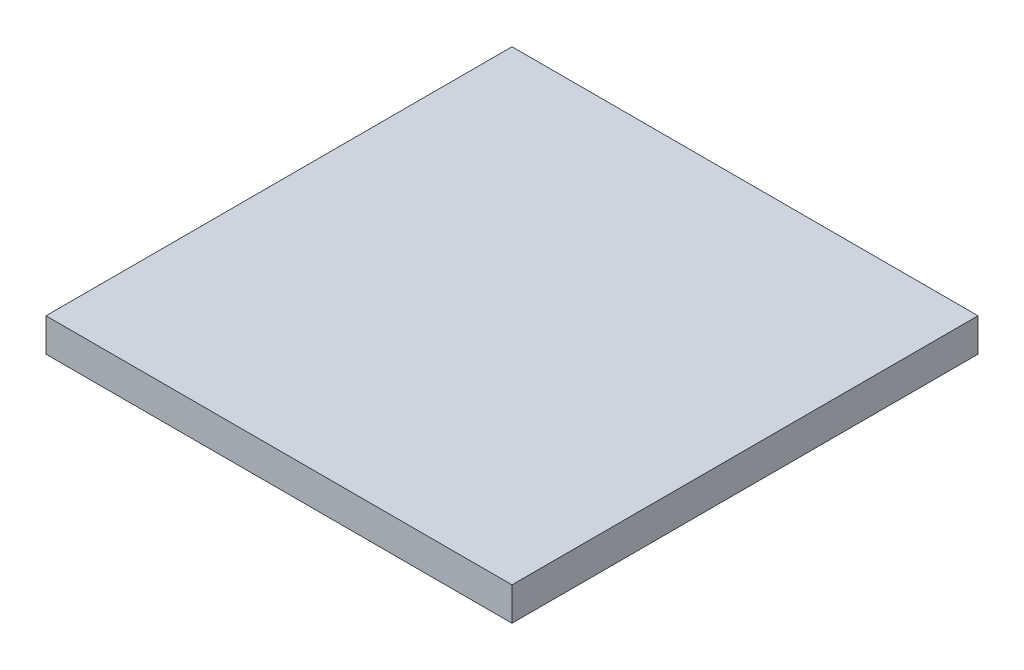
ISO-10303-21;
HEADER;
FILE_DESCRIPTION(('STEP AP214'),'2;1');
FILE_NAME('part.step','',(''),(''),'','','');
FILE_SCHEMA(('AUTOMOTIVE_DESIGN { 1 0 10303 214 1 1 1 1 }'));
ENDSEC;
DATA;
#1=APPLICATION_CONTEXT('core data for automotive mechanical design processes');
#2=APPLICATION_PROTOCOL_DEFINITION('international standard','automotive_design',2000,#1);
#3=PRODUCT_CONTEXT('',#1,'mechanical');
#4=PRODUCT('Part','Part','',(#3));
#5=PRODUCT_RELATED_PRODUCT_CATEGORY('part','',(#4));
#6=PRODUCT_DEFINITION_FORMATION('','',#4);
#7=PRODUCT_DEFINITION_CONTEXT('part definition',#1,'design');
#8=PRODUCT_DEFINITION('design','',#6,#7);
#9=PRODUCT_DEFINITION_SHAPE('','',#8);
#10=(LENGTH_UNIT() NAMED_UNIT(*) SI_UNIT(.MILLI.,.METRE.));
#11=(NAMED_UNIT(*) PLANE_ANGLE_UNIT() SI_UNIT($,.RADIAN.));
#12=(NAMED_UNIT(*) SI_UNIT($,.STERADIAN.) SOLID_ANGLE_UNIT());
#13=UNCERTAINTY_MEASURE_WITH_UNIT(LENGTH_MEASURE(1.E-05),#10,'distance_accuracy_value','');
#14=(GEOMETRIC_REPRESENTATION_CONTEXT(3) GLOBAL_UNCERTAINTY_ASSIGNED_CONTEXT((#13)) GLOBAL_UNIT_ASSIGNED_CONTEXT((#10,
#11,#12)) REPRESENTATION_CONTEXT('',''));
#15=CARTESIAN_POINT('',(0.,0.,0.));
#16=DIRECTION('',(0.,0.,1.));
#17=DIRECTION('',(1.,0.,0.));
#18=AXIS2_PLACEMENT_3D('',#15,#16,#17);
#19=CARTESIAN_POINT('',(0.,0.,0.));
#20=DIRECTION('',(0.,1.,0.));
#21=DIRECTION('',(0.,0.,1.));
#22=AXIS2_PLACEMENT_3D('',#19,#20,#21);
#23=PLANE('',#22);
#24=DIRECTION('',(-1.,0.,0.));
#25=VECTOR('',#24,1.);
#26=CARTESIAN_POINT('',(7.,0.,-7.));
#27=LINE('',#26,#25);
#28=CARTESIAN_POINT('',(7.,0.,-7.));
#29=VERTEX_POINT('',#28);
#30=CARTESIAN_POINT('',(-7.,0.,-7.));
#31=VERTEX_POINT('',#30);
#32=EDGE_CURVE('E19',#29,#31,#27,.T.);
#33=ORIENTED_EDGE('',*,*,#32,.F.);
#34=DIRECTION('',(0.,0.,-1.));
#35=VECTOR('',#34,1.);
#36=CARTESIAN_POINT('',(7.,0.,7.));
#37=LINE('',#36,#35);
#38=CARTESIAN_POINT('',(7.,0.,7.));
#39=VERTEX_POINT('',#38);
#40=EDGE_CURVE('E79',#39,#29,#37,.T.);
#41=ORIENTED_EDGE('',*,*,#40,.F.);
#42=DIRECTION('',(1.,0.,0.));
#43=VECTOR('',#42,1.);
#44=CARTESIAN_POINT('',(-7.,0.,7.));
#45=LINE('',#44,#43);
#46=CARTESIAN_POINT('',(-7.,0.,7.));
#47=VERTEX_POINT('',#46);
#48=EDGE_CURVE('E67',#47,#39,#45,.T.);
#49=ORIENTED_EDGE('',*,*,#48,.F.);
#50=DIRECTION('',(0.,0.,1.));
#51=VECTOR('',#50,1.);
#52=CARTESIAN_POINT('',(-7.,0.,-7.));
#53=LINE('',#52,#51);
#54=EDGE_CURVE('E54',#31,#47,#53,.T.);
#55=ORIENTED_EDGE('',*,*,#54,.F.);
#56=EDGE_LOOP('',(#33,#41,#49,#55));
#57=FACE_BOUND('',#56,.T.);
#58=ADVANCED_FACE('F16',(#57),#23,.F.);
#59=CARTESIAN_POINT('',(7.,0.,-7.));
#60=DIRECTION('',(0.,0.,-1.));
#61=DIRECTION('',(-1.,0.,0.));
#62=AXIS2_PLACEMENT_3D('',#59,#60,#61);
#63=PLANE('',#62);
#64=ORIENTED_EDGE('',*,*,#32,.T.);
#65=DIRECTION('',(0.,1.,0.));
#66=VECTOR('',#65,1.);
#67=CARTESIAN_POINT('',(-7.,0.,-7.));
#68=LINE('',#67,#66);
#69=CARTESIAN_POINT('',(-7.,1.,-7.));
#70=VERTEX_POINT('',#69);
#71=EDGE_CURVE('E60',#70,#31,#68,.F.);
#72=ORIENTED_EDGE('',*,*,#71,.F.);
#73=DIRECTION('',(1.,0.,0.));
#74=VECTOR('',#73,1.);
#75=CARTESIAN_POINT('',(0.,1.,-7.));
#76=LINE('',#75,#74);
#77=CARTESIAN_POINT('',(7.,1.,-7.));
#78=VERTEX_POINT('',#77);
#79=EDGE_CURVE('E82',#78,#70,#76,.F.);
#80=ORIENTED_EDGE('',*,*,#79,.F.);
#81=DIRECTION('',(0.,1.,0.));
#82=VECTOR('',#81,1.);
#83=CARTESIAN_POINT('',(7.,0.,-7.));
#84=LINE('',#83,#82);
#85=EDGE_CURVE('E63',#29,#78,#84,.T.);
#86=ORIENTED_EDGE('',*,*,#85,.F.);
#87=EDGE_LOOP('',(#64,#72,#80,#86));
#88=FACE_BOUND('',#87,.T.);
#89=ADVANCED_FACE('F59',(#88),#63,.T.);
#90=CARTESIAN_POINT('',(-7.,0.,-7.));
#91=DIRECTION('',(-1.,0.,0.));
#92=DIRECTION('',(0.,0.,1.));
#93=AXIS2_PLACEMENT_3D('',#90,#91,#92);
#94=PLANE('',#93);
#95=ORIENTED_EDGE('',*,*,#54,.T.);
#96=DIRECTION('',(0.,1.,0.));
#97=VECTOR('',#96,1.);
#98=CARTESIAN_POINT('',(-7.,0.,7.));
#99=LINE('',#98,#97);
#100=CARTESIAN_POINT('',(-7.,1.,7.));
#101=VERTEX_POINT('',#100);
#102=EDGE_CURVE('E69',#101,#47,#99,.F.);
#103=ORIENTED_EDGE('',*,*,#102,.F.);
#104=DIRECTION('',(0.,0.,1.));
#105=VECTOR('',#104,1.);
#106=CARTESIAN_POINT('',(-7.,1.,0.));
#107=LINE('',#106,#105);
#108=EDGE_CURVE('E73',#70,#101,#107,.T.);
#109=ORIENTED_EDGE('',*,*,#108,.F.);
#110=ORIENTED_EDGE('',*,*,#71,.T.);
#111=EDGE_LOOP('',(#95,#103,#109,#110));
#112=FACE_BOUND('',#111,.T.);
#113=ADVANCED_FACE('F71',(#112),#94,.T.);
#114=CARTESIAN_POINT('',(-7.,0.,7.));
#115=DIRECTION('',(0.,0.,1.));
#116=DIRECTION('',(1.,0.,0.));
#117=AXIS2_PLACEMENT_3D('',#114,#115,#116);
#118=PLANE('',#117);
#119=ORIENTED_EDGE('',*,*,#48,.T.);
#120=DIRECTION('',(0.,1.,0.));
#121=VECTOR('',#120,1.);
#122=CARTESIAN_POINT('',(7.,0.,7.));
#123=LINE('',#122,#121);
#124=CARTESIAN_POINT('',(7.,1.,7.));
#125=VERTEX_POINT('',#124);
#126=EDGE_CURVE('E34',#125,#39,#123,.F.);
#127=ORIENTED_EDGE('',*,*,#126,.F.);
#128=DIRECTION('',(1.,0.,0.));
#129=VECTOR('',#128,1.);
#130=CARTESIAN_POINT('',(0.,1.,7.));
#131=LINE('',#130,#129);
#132=EDGE_CURVE('E25',#101,#125,#131,.T.);
#133=ORIENTED_EDGE('',*,*,#132,.F.);
#134=ORIENTED_EDGE('',*,*,#102,.T.);
#135=EDGE_LOOP('',(#119,#127,#133,#134));
#136=FACE_BOUND('',#135,.T.);
#137=ADVANCED_FACE('F88',(#136),#118,.T.);
#138=CARTESIAN_POINT('',(7.,0.,7.));
#139=DIRECTION('',(1.,0.,0.));
#140=DIRECTION('',(0.,0.,-1.));
#141=AXIS2_PLACEMENT_3D('',#138,#139,#140);
#142=PLANE('',#141);
#143=ORIENTED_EDGE('',*,*,#40,.T.);
#144=ORIENTED_EDGE('',*,*,#85,.T.);
#145=DIRECTION('',(0.,0.,1.));
#146=VECTOR('',#145,1.);
#147=CARTESIAN_POINT('',(7.,1.,0.));
#148=LINE('',#147,#146);
#149=EDGE_CURVE('E11',#125,#78,#148,.F.);
#150=ORIENTED_EDGE('',*,*,#149,.F.);
#151=ORIENTED_EDGE('',*,*,#126,.T.);
#152=EDGE_LOOP('',(#143,#144,#150,#151));
#153=FACE_BOUND('',#152,.T.);
#154=ADVANCED_FACE('F90',(#153),#142,.T.);
#155=CARTESIAN_POINT('',(0.,1.,0.));
#156=DIRECTION('',(0.,1.,0.));
#157=DIRECTION('',(0.,0.,1.));
#158=AXIS2_PLACEMENT_3D('',#155,#156,#157);
#159=PLANE('',#158);
#160=ORIENTED_EDGE('',*,*,#132,.T.);
#161=ORIENTED_EDGE('',*,*,#149,.T.);
#162=ORIENTED_EDGE('',*,*,#79,.T.);
#163=ORIENTED_EDGE('',*,*,#108,.T.);
#164=EDGE_LOOP('',(#160,#161,#162,#163));
#165=FACE_BOUND('',#164,.T.);
#166=ADVANCED_FACE('F87',(#165),#159,.T.);
#167=CLOSED_SHELL('',(#58,#89,#113,#137,#154,#166));
#168=MANIFOLD_SOLID_BREP('B1',#167);
#169=ADVANCED_BREP_SHAPE_REPRESENTATION('',(#18,#168),#14);
#170=SHAPE_DEFINITION_REPRESENTATION(#9,#169);
ENDSEC;
END-ISO-10303-21;
